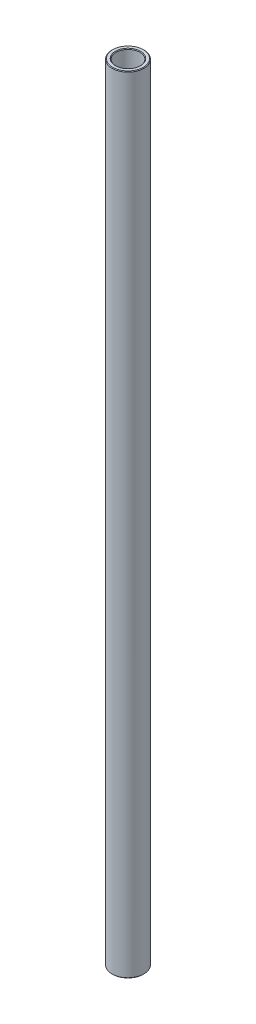
ISO-10303-21;
HEADER;
FILE_DESCRIPTION(('STEP AP214'),'2;1');
FILE_NAME('part.step','',(''),(''),'','','');
FILE_SCHEMA(('AUTOMOTIVE_DESIGN { 1 0 10303 214 1 1 1 1 }'));
ENDSEC;
DATA;
#1=APPLICATION_CONTEXT('core data for automotive mechanical design processes');
#2=APPLICATION_PROTOCOL_DEFINITION('international standard','automotive_design',2000,#1);
#3=PRODUCT_CONTEXT('',#1,'mechanical');
#4=PRODUCT('Part','Part','',(#3));
#5=PRODUCT_RELATED_PRODUCT_CATEGORY('part','',(#4));
#6=PRODUCT_DEFINITION_FORMATION('','',#4);
#7=PRODUCT_DEFINITION_CONTEXT('part definition',#1,'design');
#8=PRODUCT_DEFINITION('design','',#6,#7);
#9=PRODUCT_DEFINITION_SHAPE('','',#8);
#10=(LENGTH_UNIT() NAMED_UNIT(*) SI_UNIT(.MILLI.,.METRE.));
#11=(NAMED_UNIT(*) PLANE_ANGLE_UNIT() SI_UNIT($,.RADIAN.));
#12=(NAMED_UNIT(*) SI_UNIT($,.STERADIAN.) SOLID_ANGLE_UNIT());
#13=UNCERTAINTY_MEASURE_WITH_UNIT(LENGTH_MEASURE(1.E-05),#10,'distance_accuracy_value','');
#14=(GEOMETRIC_REPRESENTATION_CONTEXT(3) GLOBAL_UNCERTAINTY_ASSIGNED_CONTEXT((#13)) GLOBAL_UNIT_ASSIGNED_CONTEXT((#10,
#11,#12)) REPRESENTATION_CONTEXT('',''));
#15=CARTESIAN_POINT('',(0.,0.,0.));
#16=DIRECTION('',(0.,0.,1.));
#17=DIRECTION('',(1.,0.,0.));
#18=AXIS2_PLACEMENT_3D('',#15,#16,#17);
#19=CARTESIAN_POINT('',(0.,11.60859375,0.));
#20=DIRECTION('',(0.,1.,0.));
#21=DIRECTION('',(-1.,0.,0.));
#22=AXIS2_PLACEMENT_3D('',#19,#20,#21);
#23=CYLINDRICAL_SURFACE('',#22,4.7625);
#24=CARTESIAN_POINT('',(0.,-156.511625,0.));
#25=DIRECTION('',(0.,1.,0.));
#26=DIRECTION('',(-1.,0.,0.));
#27=AXIS2_PLACEMENT_3D('',#24,#25,#26);
#28=CIRCLE('',#27,4.7625);
#29=CARTESIAN_POINT('',(-4.76250000000002,-156.511625,0.));
#30=VERTEX_POINT('',#29);
#31=EDGE_CURVE('E50',#30,#30,#28,.F.);
#32=ORIENTED_EDGE('',*,*,#31,.T.);
#33=EDGE_LOOP('',(#32));
#34=FACE_BOUND('',#33,.T.);
#35=CARTESIAN_POINT('',(0.,156.511625,0.));
#36=DIRECTION('',(0.,-1.,0.));
#37=DIRECTION('',(1.,0.,0.));
#38=AXIS2_PLACEMENT_3D('',#35,#36,#37);
#39=CIRCLE('',#38,4.7625);
#40=CARTESIAN_POINT('',(4.76250000000002,156.511625,0.));
#41=VERTEX_POINT('',#40);
#42=EDGE_CURVE('E53',#41,#41,#39,.F.);
#43=ORIENTED_EDGE('',*,*,#42,.T.);
#44=EDGE_LOOP('',(#43));
#45=FACE_BOUND('',#44,.T.);
#46=ADVANCED_FACE('F30',(#34,#45),#23,.F.);
#47=CARTESIAN_POINT('',(4.76249999999998,156.765625,0.));
#48=DIRECTION('',(0.,-1.,0.));
#49=DIRECTION('',(1.,0.,0.));
#50=AXIS2_PLACEMENT_3D('',#47,#48,#49);
#51=PLANE('',#50);
#52=CARTESIAN_POINT('',(0.,156.765625,0.));
#53=DIRECTION('',(0.,-1.,0.));
#54=DIRECTION('',(1.,0.,0.));
#55=AXIS2_PLACEMENT_3D('',#52,#53,#54);
#56=CIRCLE('',#55,6.09599999999996);
#57=CARTESIAN_POINT('',(6.09599999999998,156.765625,0.));
#58=VERTEX_POINT('',#57);
#59=EDGE_CURVE('E10',#58,#58,#56,.F.);
#60=ORIENTED_EDGE('',*,*,#59,.T.);
#61=EDGE_LOOP('',(#60));
#62=FACE_BOUND('',#61,.T.);
#63=CARTESIAN_POINT('',(0.,156.765625,0.));
#64=DIRECTION('',(0.,-1.,0.));
#65=DIRECTION('',(1.,0.,0.));
#66=AXIS2_PLACEMENT_3D('',#63,#64,#65);
#67=CIRCLE('',#66,5.01649999999987);
#68=CARTESIAN_POINT('',(5.01649999999989,156.765625,0.));
#69=VERTEX_POINT('',#68);
#70=EDGE_CURVE('E37',#69,#69,#67,.T.);
#71=ORIENTED_EDGE('',*,*,#70,.T.);
#72=EDGE_LOOP('',(#71));
#73=FACE_BOUND('',#72,.T.);
#74=ADVANCED_FACE('F76',(#62,#73),#51,.F.);
#75=CARTESIAN_POINT('',(0.,11.60859375,0.));
#76=DIRECTION('',(0.,1.,0.));
#77=DIRECTION('',(-1.,0.,0.));
#78=AXIS2_PLACEMENT_3D('',#75,#76,#77);
#79=CYLINDRICAL_SURFACE('',#78,6.35);
#80=CARTESIAN_POINT('',(0.,-156.511625,0.));
#81=DIRECTION('',(0.,1.,0.));
#82=DIRECTION('',(-1.,0.,0.));
#83=AXIS2_PLACEMENT_3D('',#80,#81,#82);
#84=CIRCLE('',#83,6.35);
#85=CARTESIAN_POINT('',(-6.35000000000002,-156.511625,0.));
#86=VERTEX_POINT('',#85);
#87=EDGE_CURVE('E41',#86,#86,#84,.T.);
#88=ORIENTED_EDGE('',*,*,#87,.T.);
#89=EDGE_LOOP('',(#88));
#90=FACE_BOUND('',#89,.T.);
#91=CARTESIAN_POINT('',(0.,156.511625,0.));
#92=DIRECTION('',(0.,-1.,0.));
#93=DIRECTION('',(1.,0.,0.));
#94=AXIS2_PLACEMENT_3D('',#91,#92,#93);
#95=CIRCLE('',#94,6.35);
#96=CARTESIAN_POINT('',(6.35000000000002,156.511625,0.));
#97=VERTEX_POINT('',#96);
#98=EDGE_CURVE('E45',#97,#97,#95,.T.);
#99=ORIENTED_EDGE('',*,*,#98,.T.);
#100=EDGE_LOOP('',(#99));
#101=FACE_BOUND('',#100,.T.);
#102=ADVANCED_FACE('F73',(#90,#101),#79,.T.);
#103=CARTESIAN_POINT('',(6.35000000000002,-156.765625,0.));
#104=DIRECTION('',(0.,1.,0.));
#105=DIRECTION('',(-1.,0.,0.));
#106=AXIS2_PLACEMENT_3D('',#103,#104,#105);
#107=PLANE('',#106);
#108=CARTESIAN_POINT('',(0.,-156.765625,0.));
#109=DIRECTION('',(0.,1.,0.));
#110=DIRECTION('',(-1.,0.,0.));
#111=AXIS2_PLACEMENT_3D('',#108,#109,#110);
#112=CIRCLE('',#111,5.01650000000003);
#113=CARTESIAN_POINT('',(-5.01650000000005,-156.765625,0.));
#114=VERTEX_POINT('',#113);
#115=EDGE_CURVE('E56',#114,#114,#112,.T.);
#116=ORIENTED_EDGE('',*,*,#115,.T.);
#117=EDGE_LOOP('',(#116));
#118=FACE_BOUND('',#117,.T.);
#119=CARTESIAN_POINT('',(0.,-156.765625,0.));
#120=DIRECTION('',(0.,1.,0.));
#121=DIRECTION('',(-1.,0.,0.));
#122=AXIS2_PLACEMENT_3D('',#119,#120,#121);
#123=CIRCLE('',#122,6.09600000000013);
#124=CARTESIAN_POINT('',(-6.09600000000015,-156.765625,0.));
#125=VERTEX_POINT('',#124);
#126=EDGE_CURVE('E59',#125,#125,#123,.F.);
#127=ORIENTED_EDGE('',*,*,#126,.T.);
#128=EDGE_LOOP('',(#127));
#129=FACE_BOUND('',#128,.T.);
#130=ADVANCED_FACE('F63',(#118,#129),#107,.F.);
#131=CARTESIAN_POINT('',(0.,-156.765625,0.));
#132=DIRECTION('',(0.,-1.,0.));
#133=DIRECTION('',(1.,0.,0.));
#134=AXIS2_PLACEMENT_3D('',#131,#132,#133);
#135=CONICAL_SURFACE('',#134,5.01650000000003,0.78539816339745);
#136=ORIENTED_EDGE('',*,*,#31,.F.);
#137=EDGE_LOOP('',(#136));
#138=FACE_BOUND('',#137,.T.);
#139=ORIENTED_EDGE('',*,*,#115,.F.);
#140=EDGE_LOOP('',(#139));
#141=FACE_BOUND('',#140,.T.);
#142=ADVANCED_FACE('F69',(#138,#141),#135,.F.);
#143=CARTESIAN_POINT('',(0.,-156.511625,0.));
#144=DIRECTION('',(0.,1.,0.));
#145=DIRECTION('',(-1.,0.,0.));
#146=AXIS2_PLACEMENT_3D('',#143,#144,#145);
#147=CONICAL_SURFACE('',#146,6.35,0.785398163397406);
#148=ORIENTED_EDGE('',*,*,#126,.F.);
#149=EDGE_LOOP('',(#148));
#150=FACE_BOUND('',#149,.T.);
#151=ORIENTED_EDGE('',*,*,#87,.F.);
#152=EDGE_LOOP('',(#151));
#153=FACE_BOUND('',#152,.T.);
#154=ADVANCED_FACE('F65',(#150,#153),#147,.T.);
#155=CARTESIAN_POINT('',(0.,156.765625,0.));
#156=DIRECTION('',(0.,-1.,0.));
#157=DIRECTION('',(1.,0.,0.));
#158=AXIS2_PLACEMENT_3D('',#155,#156,#157);
#159=CONICAL_SURFACE('',#158,6.09599999999996,0.78539816339746);
#160=ORIENTED_EDGE('',*,*,#98,.F.);
#161=EDGE_LOOP('',(#160));
#162=FACE_BOUND('',#161,.T.);
#163=ORIENTED_EDGE('',*,*,#59,.F.);
#164=EDGE_LOOP('',(#163));
#165=FACE_BOUND('',#164,.T.);
#166=ADVANCED_FACE('F68',(#162,#165),#159,.T.);
#167=CARTESIAN_POINT('',(0.,156.511625,0.));
#168=DIRECTION('',(0.,1.,0.));
#169=DIRECTION('',(-1.,0.,0.));
#170=AXIS2_PLACEMENT_3D('',#167,#168,#169);
#171=CONICAL_SURFACE('',#170,4.7625,0.78539816339745);
#172=ORIENTED_EDGE('',*,*,#70,.F.);
#173=EDGE_LOOP('',(#172));
#174=FACE_BOUND('',#173,.T.);
#175=ORIENTED_EDGE('',*,*,#42,.F.);
#176=EDGE_LOOP('',(#175));
#177=FACE_BOUND('',#176,.T.);
#178=ADVANCED_FACE('F32',(#174,#177),#171,.F.);
#179=CLOSED_SHELL('',(#46,#74,#102,#130,#142,#154,#166,#178));
#180=MANIFOLD_SOLID_BREP('B2',#179);
#181=ADVANCED_BREP_SHAPE_REPRESENTATION('',(#18,#180),#14);
#182=SHAPE_DEFINITION_REPRESENTATION(#9,#181);
ENDSEC;
END-ISO-10303-21;
